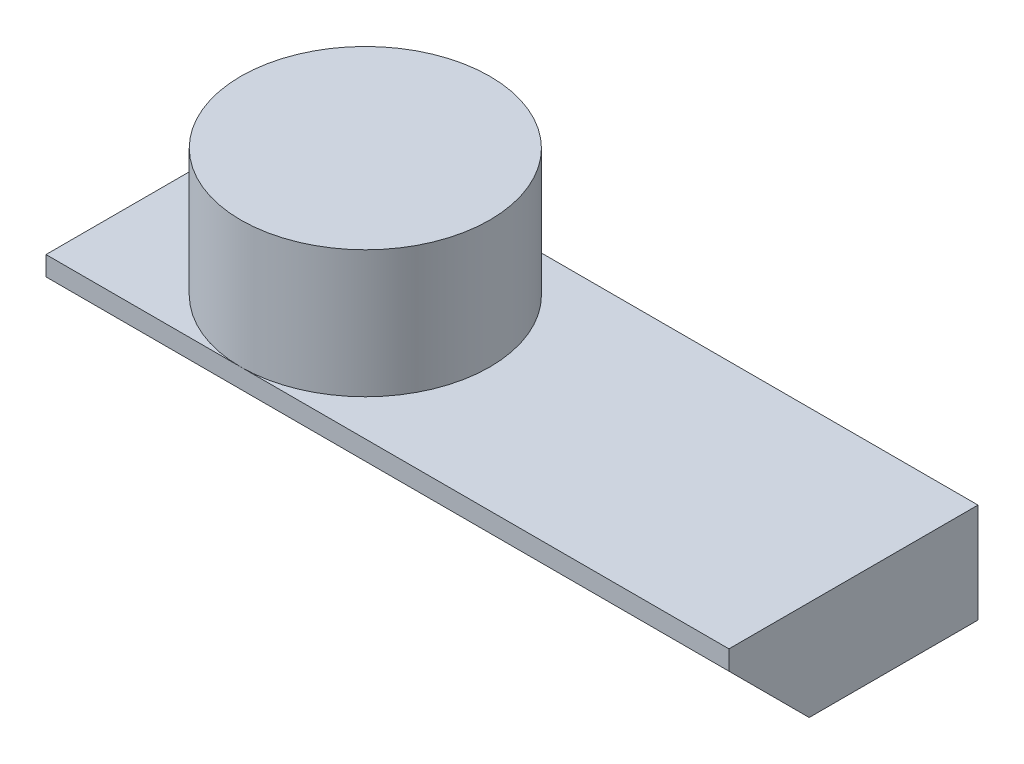
ISO-10303-21;
HEADER;
FILE_DESCRIPTION(('STEP AP214'),'2;1');
FILE_NAME('part.step','',(''),(''),'','','');
FILE_SCHEMA(('AUTOMOTIVE_DESIGN { 1 0 10303 214 1 1 1 1 }'));
ENDSEC;
DATA;
#1=APPLICATION_CONTEXT('core data for automotive mechanical design processes');
#2=APPLICATION_PROTOCOL_DEFINITION('international standard','automotive_design',2000,#1);
#3=PRODUCT_CONTEXT('',#1,'mechanical');
#4=PRODUCT('Part','Part','',(#3));
#5=PRODUCT_RELATED_PRODUCT_CATEGORY('part','',(#4));
#6=PRODUCT_DEFINITION_FORMATION('','',#4);
#7=PRODUCT_DEFINITION_CONTEXT('part definition',#1,'design');
#8=PRODUCT_DEFINITION('design','',#6,#7);
#9=PRODUCT_DEFINITION_SHAPE('','',#8);
#10=(LENGTH_UNIT() NAMED_UNIT(*) SI_UNIT(.MILLI.,.METRE.));
#11=(NAMED_UNIT(*) PLANE_ANGLE_UNIT() SI_UNIT($,.RADIAN.));
#12=(NAMED_UNIT(*) SI_UNIT($,.STERADIAN.) SOLID_ANGLE_UNIT());
#13=UNCERTAINTY_MEASURE_WITH_UNIT(LENGTH_MEASURE(1.E-05),#10,'distance_accuracy_value','');
#14=(GEOMETRIC_REPRESENTATION_CONTEXT(3) GLOBAL_UNCERTAINTY_ASSIGNED_CONTEXT((#13)) GLOBAL_UNIT_ASSIGNED_CONTEXT((#10,
#11,#12)) REPRESENTATION_CONTEXT('',''));
#15=CARTESIAN_POINT('',(0.,0.,0.));
#16=DIRECTION('',(0.,0.,1.));
#17=DIRECTION('',(1.,0.,0.));
#18=AXIS2_PLACEMENT_3D('',#15,#16,#17);
#19=CARTESIAN_POINT('',(0.,-1.15,0.));
#20=DIRECTION('',(0.,1.,0.));
#21=DIRECTION('',(0.,0.,1.));
#22=AXIS2_PLACEMENT_3D('',#19,#20,#21);
#23=CYLINDRICAL_SURFACE('',#22,2.25);
#24=CARTESIAN_POINT('',(0.,-1.15,0.));
#25=DIRECTION('',(0.,1.,0.));
#26=DIRECTION('',(0.,0.,1.));
#27=AXIS2_PLACEMENT_3D('',#24,#25,#26);
#28=CIRCLE('',#27,2.25);
#29=CARTESIAN_POINT('',(0.,-1.15,2.25));
#30=VERTEX_POINT('',#29);
#31=CARTESIAN_POINT('',(0.,-1.15,-2.25));
#32=VERTEX_POINT('',#31);
#33=EDGE_CURVE('E127',#30,#32,#28,.T.);
#34=ORIENTED_EDGE('',*,*,#33,.T.);
#35=EDGE_CURVE('E121',#32,#30,#28,.T.);
#36=ORIENTED_EDGE('',*,*,#35,.T.);
#37=EDGE_LOOP('',(#34,#36));
#38=FACE_BOUND('',#37,.T.);
#39=CARTESIAN_POINT('',(0.,1.15,0.));
#40=DIRECTION('',(0.,1.,0.));
#41=DIRECTION('',(0.,0.,1.));
#42=AXIS2_PLACEMENT_3D('',#39,#40,#41);
#43=CIRCLE('',#42,2.25);
#44=CARTESIAN_POINT('',(0.,1.15,2.25));
#45=VERTEX_POINT('',#44);
#46=EDGE_CURVE('E117',#45,#45,#43,.T.);
#47=ORIENTED_EDGE('',*,*,#46,.F.);
#48=EDGE_LOOP('',(#47));
#49=FACE_BOUND('',#48,.T.);
#50=ADVANCED_FACE('F38',(#38,#49),#23,.T.);
#51=CARTESIAN_POINT('',(0.,1.15,0.));
#52=DIRECTION('',(0.,1.,0.));
#53=DIRECTION('',(0.,0.,1.));
#54=AXIS2_PLACEMENT_3D('',#51,#52,#53);
#55=PLANE('',#54);
#56=ORIENTED_EDGE('',*,*,#46,.T.);
#57=EDGE_LOOP('',(#56));
#58=FACE_BOUND('',#57,.T.);
#59=ADVANCED_FACE('F155',(#58),#55,.T.);
#60=CARTESIAN_POINT('',(0.,-1.15,0.));
#61=DIRECTION('',(0.,1.,0.));
#62=DIRECTION('',(0.,0.,1.));
#63=AXIS2_PLACEMENT_3D('',#60,#61,#62);
#64=PLANE('',#63);
#65=ORIENTED_EDGE('',*,*,#33,.F.);
#66=DIRECTION('',(-1.,0.,0.));
#67=VECTOR('',#66,1.);
#68=CARTESIAN_POINT('',(-3.52,-1.15,2.25));
#69=LINE('',#68,#67);
#70=CARTESIAN_POINT('',(8.82,-1.15,2.25));
#71=VERTEX_POINT('',#70);
#72=EDGE_CURVE('E261',#71,#30,#69,.T.);
#73=ORIENTED_EDGE('',*,*,#72,.F.);
#74=DIRECTION('',(0.,0.,1.));
#75=VECTOR('',#74,1.);
#76=CARTESIAN_POINT('',(8.82,-1.15,2.25));
#77=LINE('',#76,#75);
#78=CARTESIAN_POINT('',(8.82,-1.15,-2.25));
#79=VERTEX_POINT('',#78);
#80=EDGE_CURVE('E255',#79,#71,#77,.T.);
#81=ORIENTED_EDGE('',*,*,#80,.F.);
#82=DIRECTION('',(1.,0.,0.));
#83=VECTOR('',#82,1.);
#84=CARTESIAN_POINT('',(-3.52,-1.15,-2.25));
#85=LINE('',#84,#83);
#86=EDGE_CURVE('E115',#32,#79,#85,.T.);
#87=ORIENTED_EDGE('',*,*,#86,.F.);
#88=EDGE_LOOP('',(#65,#73,#81,#87));
#89=FACE_BOUND('',#88,.T.);
#90=ADVANCED_FACE('F161',(#89),#64,.T.);
#91=ORIENTED_EDGE('',*,*,#35,.F.);
#92=CARTESIAN_POINT('',(-3.52,-1.15,-2.25));
#93=VERTEX_POINT('',#92);
#94=EDGE_CURVE('E100',#93,#32,#85,.T.);
#95=ORIENTED_EDGE('',*,*,#94,.F.);
#96=DIRECTION('',(0.,0.,-1.));
#97=VECTOR('',#96,1.);
#98=CARTESIAN_POINT('',(-3.52,-1.15,2.25));
#99=LINE('',#98,#97);
#100=CARTESIAN_POINT('',(-3.52,-1.15,2.25));
#101=VERTEX_POINT('',#100);
#102=EDGE_CURVE('E256',#101,#93,#99,.T.);
#103=ORIENTED_EDGE('',*,*,#102,.F.);
#104=EDGE_CURVE('E146',#30,#101,#69,.T.);
#105=ORIENTED_EDGE('',*,*,#104,.F.);
#106=EDGE_LOOP('',(#91,#95,#103,#105));
#107=FACE_BOUND('',#106,.T.);
#108=ADVANCED_FACE('F168',(#107),#64,.T.);
#109=CARTESIAN_POINT('',(8.82,-2.95,2.25));
#110=DIRECTION('',(-1.,0.,0.));
#111=DIRECTION('',(0.,0.,1.));
#112=AXIS2_PLACEMENT_3D('',#109,#110,#111);
#113=PLANE('',#112);
#114=DIRECTION('',(0.,1.,0.));
#115=VECTOR('',#114,1.);
#116=CARTESIAN_POINT('',(8.82,-2.95,2.25));
#117=LINE('',#116,#115);
#118=CARTESIAN_POINT('',(8.82,-1.49999999999999,2.25));
#119=VERTEX_POINT('',#118);
#120=EDGE_CURVE('E118',#119,#71,#117,.T.);
#121=ORIENTED_EDGE('',*,*,#120,.F.);
#122=DIRECTION('',(0.,0.707106781186549,0.707106781186546));
#123=VECTOR('',#122,1.);
#124=CARTESIAN_POINT('',(8.82,-2.95,0.800000000000001));
#125=LINE('',#124,#123);
#126=CARTESIAN_POINT('',(8.82,-2.95,0.799999999999999));
#127=VERTEX_POINT('',#126);
#128=EDGE_CURVE('E109',#119,#127,#125,.F.);
#129=ORIENTED_EDGE('',*,*,#128,.T.);
#130=DIRECTION('',(0.,0.,1.));
#131=VECTOR('',#130,1.);
#132=CARTESIAN_POINT('',(8.82,-2.95,2.25));
#133=LINE('',#132,#131);
#134=CARTESIAN_POINT('',(8.82,-2.95,-2.25));
#135=VERTEX_POINT('',#134);
#136=EDGE_CURVE('E96',#135,#127,#133,.T.);
#137=ORIENTED_EDGE('',*,*,#136,.F.);
#138=DIRECTION('',(0.,1.,0.));
#139=VECTOR('',#138,1.);
#140=CARTESIAN_POINT('',(8.82,-2.95,-2.25));
#141=LINE('',#140,#139);
#142=EDGE_CURVE('E107',#135,#79,#141,.T.);
#143=ORIENTED_EDGE('',*,*,#142,.T.);
#144=ORIENTED_EDGE('',*,*,#80,.T.);
#145=EDGE_LOOP('',(#121,#129,#137,#143,#144));
#146=FACE_BOUND('',#145,.T.);
#147=ADVANCED_FACE('F105',(#146),#113,.F.);
#148=CARTESIAN_POINT('',(-3.52,-2.95,2.25));
#149=DIRECTION('',(0.,0.,-1.));
#150=DIRECTION('',(-1.,0.,0.));
#151=AXIS2_PLACEMENT_3D('',#148,#149,#150);
#152=PLANE('',#151);
#153=DIRECTION('',(0.,1.,0.));
#154=VECTOR('',#153,1.);
#155=CARTESIAN_POINT('',(-3.52,-2.95,2.25));
#156=LINE('',#155,#154);
#157=CARTESIAN_POINT('',(-3.52,-1.49999999999999,2.25));
#158=VERTEX_POINT('',#157);
#159=EDGE_CURVE('E123',#158,#101,#156,.T.);
#160=ORIENTED_EDGE('',*,*,#159,.F.);
#161=DIRECTION('',(1.,0.,0.));
#162=VECTOR('',#161,1.);
#163=CARTESIAN_POINT('',(-3.52,-1.49999999999999,2.25));
#164=LINE('',#163,#162);
#165=EDGE_CURVE('E132',#158,#119,#164,.T.);
#166=ORIENTED_EDGE('',*,*,#165,.T.);
#167=ORIENTED_EDGE('',*,*,#120,.T.);
#168=ORIENTED_EDGE('',*,*,#72,.T.);
#169=ORIENTED_EDGE('',*,*,#104,.T.);
#170=EDGE_LOOP('',(#160,#166,#167,#168,#169));
#171=FACE_BOUND('',#170,.T.);
#172=ADVANCED_FACE('F144',(#171),#152,.F.);
#173=CARTESIAN_POINT('',(-3.52,-2.95,2.25));
#174=DIRECTION('',(1.,0.,0.));
#175=DIRECTION('',(0.,0.,-1.));
#176=AXIS2_PLACEMENT_3D('',#173,#174,#175);
#177=PLANE('',#176);
#178=DIRECTION('',(0.,1.,0.));
#179=VECTOR('',#178,1.);
#180=CARTESIAN_POINT('',(-3.52,-2.95,-2.25));
#181=LINE('',#180,#179);
#182=CARTESIAN_POINT('',(-3.52,-1.5,-2.25));
#183=VERTEX_POINT('',#182);
#184=EDGE_CURVE('E110',#183,#93,#181,.T.);
#185=ORIENTED_EDGE('',*,*,#184,.F.);
#186=DIRECTION('',(0.,0.,1.));
#187=VECTOR('',#186,1.);
#188=CARTESIAN_POINT('',(-3.52,-1.5,2.25));
#189=LINE('',#188,#187);
#190=EDGE_CURVE('E46',#183,#158,#189,.T.);
#191=ORIENTED_EDGE('',*,*,#190,.T.);
#192=ORIENTED_EDGE('',*,*,#159,.T.);
#193=ORIENTED_EDGE('',*,*,#102,.T.);
#194=EDGE_LOOP('',(#185,#191,#192,#193));
#195=FACE_BOUND('',#194,.T.);
#196=ADVANCED_FACE('F138',(#195),#177,.F.);
#197=CARTESIAN_POINT('',(-3.52,-2.95,-2.25));
#198=DIRECTION('',(0.,0.,1.));
#199=DIRECTION('',(1.,0.,0.));
#200=AXIS2_PLACEMENT_3D('',#197,#198,#199);
#201=PLANE('',#200);
#202=DIRECTION('',(1.,0.,0.));
#203=VECTOR('',#202,1.);
#204=CARTESIAN_POINT('',(3.52,-2.95,-2.25));
#205=LINE('',#204,#203);
#206=CARTESIAN_POINT('',(-2.07,-2.95,-2.25));
#207=VERTEX_POINT('',#206);
#208=EDGE_CURVE('E92',#207,#135,#205,.T.);
#209=ORIENTED_EDGE('',*,*,#208,.F.);
#210=DIRECTION('',(0.707106781186546,-0.707106781186549,0.));
#211=VECTOR('',#210,1.);
#212=CARTESIAN_POINT('',(-2.07,-2.95,-2.25));
#213=LINE('',#212,#211);
#214=EDGE_CURVE('E53',#207,#183,#213,.F.);
#215=ORIENTED_EDGE('',*,*,#214,.T.);
#216=ORIENTED_EDGE('',*,*,#184,.T.);
#217=ORIENTED_EDGE('',*,*,#94,.T.);
#218=ORIENTED_EDGE('',*,*,#86,.T.);
#219=ORIENTED_EDGE('',*,*,#142,.F.);
#220=EDGE_LOOP('',(#209,#215,#216,#217,#218,#219));
#221=FACE_BOUND('',#220,.T.);
#222=ADVANCED_FACE('F112',(#221),#201,.F.);
#223=CARTESIAN_POINT('',(0.,-2.95,0.));
#224=DIRECTION('',(0.,1.,0.));
#225=DIRECTION('',(0.,0.,1.));
#226=AXIS2_PLACEMENT_3D('',#223,#224,#225);
#227=PLANE('',#226);
#228=DIRECTION('',(-1.,0.,0.));
#229=VECTOR('',#228,1.);
#230=CARTESIAN_POINT('',(0.,-2.95,0.799999999999999));
#231=LINE('',#230,#229);
#232=CARTESIAN_POINT('',(-2.07,-2.95,0.799999999999999));
#233=VERTEX_POINT('',#232);
#234=EDGE_CURVE('E130',#127,#233,#231,.T.);
#235=ORIENTED_EDGE('',*,*,#234,.T.);
#236=DIRECTION('',(0.,0.,-1.));
#237=VECTOR('',#236,1.);
#238=CARTESIAN_POINT('',(-2.07,-2.95,0.));
#239=LINE('',#238,#237);
#240=EDGE_CURVE('E98',#233,#207,#239,.T.);
#241=ORIENTED_EDGE('',*,*,#240,.T.);
#242=ORIENTED_EDGE('',*,*,#208,.T.);
#243=ORIENTED_EDGE('',*,*,#136,.T.);
#244=EDGE_LOOP('',(#235,#241,#242,#243));
#245=FACE_BOUND('',#244,.T.);
#246=ADVANCED_FACE('F95',(#245),#227,.F.);
#247=CARTESIAN_POINT('',(0.,-2.95,0.799999999999999));
#248=DIRECTION('',(0.,0.707106781186546,-0.707106781186549));
#249=DIRECTION('',(-1.,0.,0.));
#250=AXIS2_PLACEMENT_3D('',#247,#248,#249);
#251=PLANE('',#250);
#252=ORIENTED_EDGE('',*,*,#165,.F.);
#253=DIRECTION('',(0.577350269189625,-0.577350269189627,-0.577350269189625));
#254=VECTOR('',#253,1.);
#255=CARTESIAN_POINT('',(-1.38,-3.64,0.11));
#256=LINE('',#255,#254);
#257=EDGE_CURVE('E11',#158,#233,#256,.T.);
#258=ORIENTED_EDGE('',*,*,#257,.T.);
#259=ORIENTED_EDGE('',*,*,#234,.F.);
#260=ORIENTED_EDGE('',*,*,#128,.F.);
#261=EDGE_LOOP('',(#252,#258,#259,#260));
#262=FACE_BOUND('',#261,.T.);
#263=ADVANCED_FACE('F149',(#262),#251,.F.);
#264=CARTESIAN_POINT('',(-2.07,-2.95,0.));
#265=DIRECTION('',(0.707106781186549,0.707106781186546,0.));
#266=DIRECTION('',(0.,0.,-1.));
#267=AXIS2_PLACEMENT_3D('',#264,#265,#266);
#268=PLANE('',#267);
#269=ORIENTED_EDGE('',*,*,#257,.F.);
#270=ORIENTED_EDGE('',*,*,#190,.F.);
#271=ORIENTED_EDGE('',*,*,#214,.F.);
#272=ORIENTED_EDGE('',*,*,#240,.F.);
#273=EDGE_LOOP('',(#269,#270,#271,#272));
#274=FACE_BOUND('',#273,.T.);
#275=ADVANCED_FACE('F40',(#274),#268,.F.);
#276=CLOSED_SHELL('',(#50,#59,#90,#108,#147,#172,#196,#222,#246,#263,#275));
#277=MANIFOLD_SOLID_BREP('B2',#276);
#278=ADVANCED_BREP_SHAPE_REPRESENTATION('',(#18,#277),#14);
#279=SHAPE_DEFINITION_REPRESENTATION(#9,#278);
ENDSEC;
END-ISO-10303-21;
